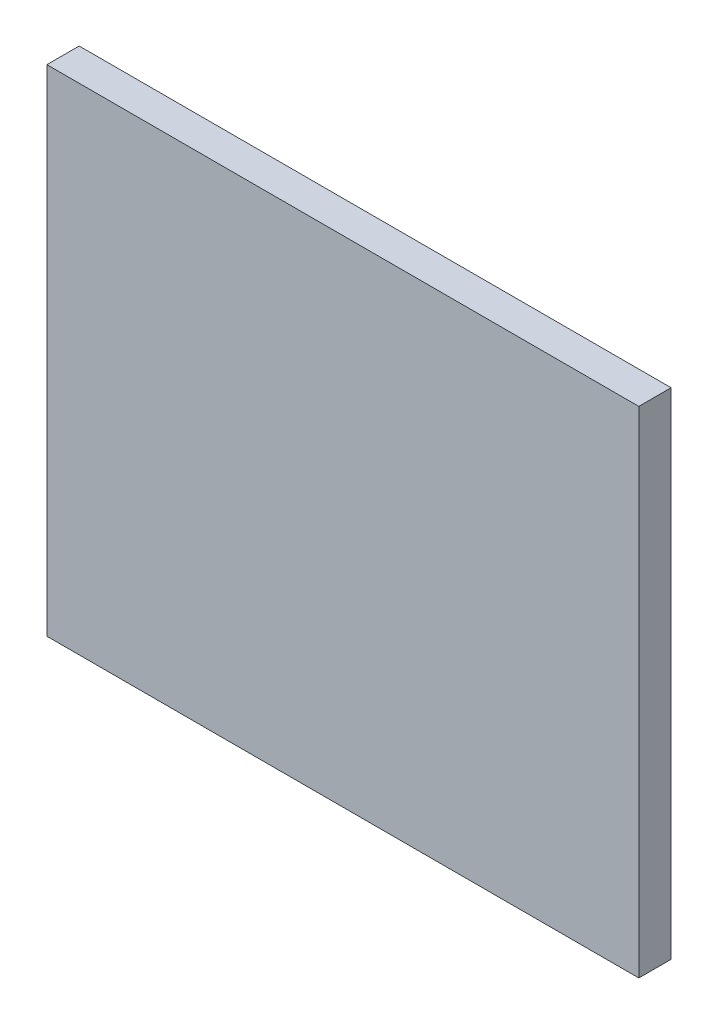
ISO-10303-21;
HEADER;
FILE_DESCRIPTION(('STEP AP214'),'2;1');
FILE_NAME('part.step','',(''),(''),'','','');
FILE_SCHEMA(('AUTOMOTIVE_DESIGN { 1 0 10303 214 1 1 1 1 }'));
ENDSEC;
DATA;
#1=APPLICATION_CONTEXT('core data for automotive mechanical design processes');
#2=APPLICATION_PROTOCOL_DEFINITION('international standard','automotive_design',2000,#1);
#3=PRODUCT_CONTEXT('',#1,'mechanical');
#4=PRODUCT('Part','Part','',(#3));
#5=PRODUCT_RELATED_PRODUCT_CATEGORY('part','',(#4));
#6=PRODUCT_DEFINITION_FORMATION('','',#4);
#7=PRODUCT_DEFINITION_CONTEXT('part definition',#1,'design');
#8=PRODUCT_DEFINITION('design','',#6,#7);
#9=PRODUCT_DEFINITION_SHAPE('','',#8);
#10=(LENGTH_UNIT() NAMED_UNIT(*) SI_UNIT(.MILLI.,.METRE.));
#11=(NAMED_UNIT(*) PLANE_ANGLE_UNIT() SI_UNIT($,.RADIAN.));
#12=(NAMED_UNIT(*) SI_UNIT($,.STERADIAN.) SOLID_ANGLE_UNIT());
#13=UNCERTAINTY_MEASURE_WITH_UNIT(LENGTH_MEASURE(1.E-05),#10,'distance_accuracy_value','');
#14=(GEOMETRIC_REPRESENTATION_CONTEXT(3) GLOBAL_UNCERTAINTY_ASSIGNED_CONTEXT((#13)) GLOBAL_UNIT_ASSIGNED_CONTEXT((#10,
#11,#12)) REPRESENTATION_CONTEXT('',''));
#15=CARTESIAN_POINT('',(0.,0.,0.));
#16=DIRECTION('',(0.,0.,1.));
#17=DIRECTION('',(1.,0.,0.));
#18=AXIS2_PLACEMENT_3D('',#15,#16,#17);
#19=CARTESIAN_POINT('',(0.,0.,0.));
#20=DIRECTION('',(0.,0.,-1.));
#21=DIRECTION('',(-1.,0.,0.));
#22=AXIS2_PLACEMENT_3D('',#19,#20,#21);
#23=PLANE('',#22);
#24=DIRECTION('',(0.,1.,0.));
#25=VECTOR('',#24,1.);
#26=CARTESIAN_POINT('',(27.5,43.,0.));
#27=LINE('',#26,#25);
#28=CARTESIAN_POINT('',(27.5,-3.,0.));
#29=VERTEX_POINT('',#28);
#30=CARTESIAN_POINT('',(27.5,43.,0.));
#31=VERTEX_POINT('',#30);
#32=EDGE_CURVE('E164',#29,#31,#27,.T.);
#33=ORIENTED_EDGE('',*,*,#32,.F.);
#34=DIRECTION('',(1.,0.,0.));
#35=VECTOR('',#34,1.);
#36=CARTESIAN_POINT('',(27.5,-3.,0.));
#37=LINE('',#36,#35);
#38=CARTESIAN_POINT('',(-27.5,-3.,0.));
#39=VERTEX_POINT('',#38);
#40=EDGE_CURVE('E170',#39,#29,#37,.T.);
#41=ORIENTED_EDGE('',*,*,#40,.F.);
#42=DIRECTION('',(0.,-1.,0.));
#43=VECTOR('',#42,1.);
#44=CARTESIAN_POINT('',(-27.5,43.,0.));
#45=LINE('',#44,#43);
#46=CARTESIAN_POINT('',(-27.5,43.,0.));
#47=VERTEX_POINT('',#46);
#48=EDGE_CURVE('E181',#47,#39,#45,.T.);
#49=ORIENTED_EDGE('',*,*,#48,.F.);
#50=DIRECTION('',(-1.,0.,0.));
#51=VECTOR('',#50,1.);
#52=CARTESIAN_POINT('',(27.5,43.,0.));
#53=LINE('',#52,#51);
#54=EDGE_CURVE('E179',#31,#47,#53,.T.);
#55=ORIENTED_EDGE('',*,*,#54,.F.);
#56=EDGE_LOOP('',(#33,#41,#49,#55));
#57=FACE_BOUND('',#56,.T.);
#58=DIRECTION('',(0.,-1.,0.));
#59=VECTOR('',#58,1.);
#60=CARTESIAN_POINT('',(24.1,17.5,0.));
#61=LINE('',#60,#59);
#62=CARTESIAN_POINT('',(24.1,24.5,0.));
#63=VERTEX_POINT('',#62);
#64=CARTESIAN_POINT('',(24.1,15.5,0.));
#65=VERTEX_POINT('',#64);
#66=EDGE_CURVE('E152',#63,#65,#61,.T.);
#67=ORIENTED_EDGE('',*,*,#66,.F.);
#68=DIRECTION('',(-1.,0.,0.));
#69=VECTOR('',#68,1.);
#70=CARTESIAN_POINT('',(0.,24.5,0.));
#71=LINE('',#70,#69);
#72=CARTESIAN_POINT('',(19.1,24.5,0.));
#73=VERTEX_POINT('',#72);
#74=EDGE_CURVE('E200',#63,#73,#71,.T.);
#75=ORIENTED_EDGE('',*,*,#74,.T.);
#76=DIRECTION('',(0.,-1.,0.));
#77=VECTOR('',#76,1.);
#78=CARTESIAN_POINT('',(19.1,0.,0.));
#79=LINE('',#78,#77);
#80=CARTESIAN_POINT('',(19.1,15.5,0.));
#81=VERTEX_POINT('',#80);
#82=EDGE_CURVE('E198',#73,#81,#79,.T.);
#83=ORIENTED_EDGE('',*,*,#82,.T.);
#84=DIRECTION('',(1.,0.,0.));
#85=VECTOR('',#84,1.);
#86=CARTESIAN_POINT('',(0.,15.5,0.));
#87=LINE('',#86,#85);
#88=EDGE_CURVE('E195',#81,#65,#87,.T.);
#89=ORIENTED_EDGE('',*,*,#88,.T.);
#90=EDGE_LOOP('',(#67,#75,#83,#89));
#91=FACE_BOUND('',#90,.T.);
#92=DIRECTION('',(0.,1.,0.));
#93=VECTOR('',#92,1.);
#94=CARTESIAN_POINT('',(-24.1,17.5,0.));
#95=LINE('',#94,#93);
#96=CARTESIAN_POINT('',(-24.1,15.5,0.));
#97=VERTEX_POINT('',#96);
#98=CARTESIAN_POINT('',(-24.1,24.5,0.));
#99=VERTEX_POINT('',#98);
#100=EDGE_CURVE('E53',#97,#99,#95,.T.);
#101=ORIENTED_EDGE('',*,*,#100,.F.);
#102=DIRECTION('',(1.,0.,0.));
#103=VECTOR('',#102,1.);
#104=CARTESIAN_POINT('',(0.,15.5,0.));
#105=LINE('',#104,#103);
#106=CARTESIAN_POINT('',(-19.1,15.5,0.));
#107=VERTEX_POINT('',#106);
#108=EDGE_CURVE('E58',#97,#107,#105,.T.);
#109=ORIENTED_EDGE('',*,*,#108,.T.);
#110=DIRECTION('',(0.,1.,0.));
#111=VECTOR('',#110,1.);
#112=CARTESIAN_POINT('',(-19.0999999999999,0.,0.));
#113=LINE('',#112,#111);
#114=CARTESIAN_POINT('',(-19.1,24.5,0.));
#115=VERTEX_POINT('',#114);
#116=EDGE_CURVE('E141',#107,#115,#113,.T.);
#117=ORIENTED_EDGE('',*,*,#116,.T.);
#118=DIRECTION('',(-1.,0.,0.));
#119=VECTOR('',#118,1.);
#120=CARTESIAN_POINT('',(0.,24.5,0.));
#121=LINE('',#120,#119);
#122=EDGE_CURVE('E202',#115,#99,#121,.T.);
#123=ORIENTED_EDGE('',*,*,#122,.T.);
#124=EDGE_LOOP('',(#101,#109,#117,#123));
#125=FACE_BOUND('',#124,.T.);
#126=ADVANCED_FACE('F35',(#57,#91,#125),#23,.T.);
#127=CARTESIAN_POINT('',(27.5,43.,3.));
#128=DIRECTION('',(-1.,0.,0.));
#129=DIRECTION('',(0.,0.,1.));
#130=AXIS2_PLACEMENT_3D('',#127,#128,#129);
#131=PLANE('',#130);
#132=ORIENTED_EDGE('',*,*,#32,.T.);
#133=DIRECTION('',(0.,0.,-1.));
#134=VECTOR('',#133,1.);
#135=CARTESIAN_POINT('',(27.5,43.,3.));
#136=LINE('',#135,#134);
#137=CARTESIAN_POINT('',(27.5,43.,3.));
#138=VERTEX_POINT('',#137);
#139=EDGE_CURVE('E192',#138,#31,#136,.T.);
#140=ORIENTED_EDGE('',*,*,#139,.F.);
#141=DIRECTION('',(0.,1.,0.));
#142=VECTOR('',#141,1.);
#143=CARTESIAN_POINT('',(27.5,43.,3.));
#144=LINE('',#143,#142);
#145=CARTESIAN_POINT('',(27.5,-3.,3.));
#146=VERTEX_POINT('',#145);
#147=EDGE_CURVE('E166',#146,#138,#144,.T.);
#148=ORIENTED_EDGE('',*,*,#147,.F.);
#149=DIRECTION('',(0.,0.,-1.));
#150=VECTOR('',#149,1.);
#151=CARTESIAN_POINT('',(27.5,-3.,3.));
#152=LINE('',#151,#150);
#153=EDGE_CURVE('E176',#146,#29,#152,.T.);
#154=ORIENTED_EDGE('',*,*,#153,.T.);
#155=EDGE_LOOP('',(#132,#140,#148,#154));
#156=FACE_BOUND('',#155,.T.);
#157=ADVANCED_FACE('F247',(#156),#131,.F.);
#158=CARTESIAN_POINT('',(27.5,43.,3.));
#159=DIRECTION('',(0.,-1.,0.));
#160=DIRECTION('',(0.,0.,-1.));
#161=AXIS2_PLACEMENT_3D('',#158,#159,#160);
#162=PLANE('',#161);
#163=ORIENTED_EDGE('',*,*,#54,.T.);
#164=DIRECTION('',(0.,0.,-1.));
#165=VECTOR('',#164,1.);
#166=CARTESIAN_POINT('',(-27.5,43.,3.));
#167=LINE('',#166,#165);
#168=CARTESIAN_POINT('',(-27.5,43.,3.));
#169=VERTEX_POINT('',#168);
#170=EDGE_CURVE('E189',#169,#47,#167,.T.);
#171=ORIENTED_EDGE('',*,*,#170,.F.);
#172=DIRECTION('',(-1.,0.,0.));
#173=VECTOR('',#172,1.);
#174=CARTESIAN_POINT('',(27.5,43.,3.));
#175=LINE('',#174,#173);
#176=EDGE_CURVE('E169',#138,#169,#175,.T.);
#177=ORIENTED_EDGE('',*,*,#176,.F.);
#178=ORIENTED_EDGE('',*,*,#139,.T.);
#179=EDGE_LOOP('',(#163,#171,#177,#178));
#180=FACE_BOUND('',#179,.T.);
#181=ADVANCED_FACE('F253',(#180),#162,.F.);
#182=CARTESIAN_POINT('',(-27.5,43.,3.));
#183=DIRECTION('',(1.,0.,0.));
#184=DIRECTION('',(0.,0.,-1.));
#185=AXIS2_PLACEMENT_3D('',#182,#183,#184);
#186=PLANE('',#185);
#187=ORIENTED_EDGE('',*,*,#48,.T.);
#188=DIRECTION('',(0.,0.,-1.));
#189=VECTOR('',#188,1.);
#190=CARTESIAN_POINT('',(-27.5,-3.,3.));
#191=LINE('',#190,#189);
#192=CARTESIAN_POINT('',(-27.5,-3.,3.));
#193=VERTEX_POINT('',#192);
#194=EDGE_CURVE('E186',#193,#39,#191,.T.);
#195=ORIENTED_EDGE('',*,*,#194,.F.);
#196=DIRECTION('',(0.,-1.,0.));
#197=VECTOR('',#196,1.);
#198=CARTESIAN_POINT('',(-27.5,43.,3.));
#199=LINE('',#198,#197);
#200=EDGE_CURVE('E172',#169,#193,#199,.T.);
#201=ORIENTED_EDGE('',*,*,#200,.F.);
#202=ORIENTED_EDGE('',*,*,#170,.T.);
#203=EDGE_LOOP('',(#187,#195,#201,#202));
#204=FACE_BOUND('',#203,.T.);
#205=ADVANCED_FACE('F260',(#204),#186,.F.);
#206=CARTESIAN_POINT('',(27.5,-3.,3.));
#207=DIRECTION('',(0.,1.,0.));
#208=DIRECTION('',(0.,0.,1.));
#209=AXIS2_PLACEMENT_3D('',#206,#207,#208);
#210=PLANE('',#209);
#211=ORIENTED_EDGE('',*,*,#40,.T.);
#212=ORIENTED_EDGE('',*,*,#153,.F.);
#213=DIRECTION('',(1.,0.,0.));
#214=VECTOR('',#213,1.);
#215=CARTESIAN_POINT('',(27.5,-3.,3.));
#216=LINE('',#215,#214);
#217=EDGE_CURVE('E174',#193,#146,#216,.T.);
#218=ORIENTED_EDGE('',*,*,#217,.F.);
#219=ORIENTED_EDGE('',*,*,#194,.T.);
#220=EDGE_LOOP('',(#211,#212,#218,#219));
#221=FACE_BOUND('',#220,.T.);
#222=ADVANCED_FACE('F243',(#221),#210,.F.);
#223=CARTESIAN_POINT('',(0.,0.,3.));
#224=DIRECTION('',(0.,0.,-1.));
#225=DIRECTION('',(-1.,0.,0.));
#226=AXIS2_PLACEMENT_3D('',#223,#224,#225);
#227=PLANE('',#226);
#228=ORIENTED_EDGE('',*,*,#147,.T.);
#229=ORIENTED_EDGE('',*,*,#176,.T.);
#230=ORIENTED_EDGE('',*,*,#200,.T.);
#231=ORIENTED_EDGE('',*,*,#217,.T.);
#232=EDGE_LOOP('',(#228,#229,#230,#231));
#233=FACE_BOUND('',#232,.T.);
#234=ADVANCED_FACE('F235',(#233),#227,.F.);
#235=CARTESIAN_POINT('',(24.1,17.5,-2.));
#236=DIRECTION('',(-1.,0.,0.));
#237=DIRECTION('',(0.,0.,1.));
#238=AXIS2_PLACEMENT_3D('',#235,#236,#237);
#239=PLANE('',#238);
#240=ORIENTED_EDGE('',*,*,#66,.T.);
#241=DIRECTION('',(0.,0.707106781186548,-0.707106781186547));
#242=VECTOR('',#241,1.);
#243=CARTESIAN_POINT('',(24.1,17.5,-2.));
#244=LINE('',#243,#242);
#245=CARTESIAN_POINT('',(24.1,17.5,-2.));
#246=VERTEX_POINT('',#245);
#247=EDGE_CURVE('E11',#65,#246,#244,.T.);
#248=ORIENTED_EDGE('',*,*,#247,.T.);
#249=DIRECTION('',(0.,-1.,0.));
#250=VECTOR('',#249,1.);
#251=CARTESIAN_POINT('',(24.1,17.5,-2.));
#252=LINE('',#251,#250);
#253=CARTESIAN_POINT('',(24.1,22.5,-2.));
#254=VERTEX_POINT('',#253);
#255=EDGE_CURVE('E154',#254,#246,#252,.T.);
#256=ORIENTED_EDGE('',*,*,#255,.F.);
#257=DIRECTION('',(0.,0.707106781186548,0.707106781186547));
#258=VECTOR('',#257,1.);
#259=CARTESIAN_POINT('',(24.1,20.,-4.5));
#260=LINE('',#259,#258);
#261=EDGE_CURVE('E45',#254,#63,#260,.T.);
#262=ORIENTED_EDGE('',*,*,#261,.T.);
#263=EDGE_LOOP('',(#240,#248,#256,#262));
#264=FACE_BOUND('',#263,.T.);
#265=ADVANCED_FACE('F233',(#264),#239,.F.);
#266=CARTESIAN_POINT('',(0.,0.,-2.));
#267=DIRECTION('',(0.,0.,-1.));
#268=DIRECTION('',(-1.,0.,0.));
#269=AXIS2_PLACEMENT_3D('',#266,#267,#268);
#270=PLANE('',#269);
#271=ORIENTED_EDGE('',*,*,#255,.T.);
#272=DIRECTION('',(-1.,0.,0.));
#273=VECTOR('',#272,1.);
#274=CARTESIAN_POINT('',(21.1,17.5,-2.));
#275=LINE('',#274,#273);
#276=CARTESIAN_POINT('',(21.1,17.5,-2.));
#277=VERTEX_POINT('',#276);
#278=EDGE_CURVE('E157',#246,#277,#275,.T.);
#279=ORIENTED_EDGE('',*,*,#278,.T.);
#280=DIRECTION('',(0.,1.,0.));
#281=VECTOR('',#280,1.);
#282=CARTESIAN_POINT('',(21.1,17.5,-2.));
#283=LINE('',#282,#281);
#284=CARTESIAN_POINT('',(21.1,22.5,-2.));
#285=VERTEX_POINT('',#284);
#286=EDGE_CURVE('E159',#277,#285,#283,.T.);
#287=ORIENTED_EDGE('',*,*,#286,.T.);
#288=DIRECTION('',(1.,0.,0.));
#289=VECTOR('',#288,1.);
#290=CARTESIAN_POINT('',(21.1,22.5,-2.));
#291=LINE('',#290,#289);
#292=EDGE_CURVE('E161',#285,#254,#291,.T.);
#293=ORIENTED_EDGE('',*,*,#292,.T.);
#294=EDGE_LOOP('',(#271,#279,#287,#293));
#295=FACE_BOUND('',#294,.T.);
#296=ADVANCED_FACE('F232',(#295),#270,.T.);
#297=CARTESIAN_POINT('',(-24.1,17.5,-2.));
#298=DIRECTION('',(1.,0.,0.));
#299=DIRECTION('',(0.,1.,0.));
#300=AXIS2_PLACEMENT_3D('',#297,#298,#299);
#301=PLANE('',#300);
#302=ORIENTED_EDGE('',*,*,#100,.T.);
#303=DIRECTION('',(0.,-0.707106781186549,-0.707106781186546));
#304=VECTOR('',#303,1.);
#305=CARTESIAN_POINT('',(-24.1,19.9999999999999,-4.5));
#306=LINE('',#305,#304);
#307=CARTESIAN_POINT('',(-24.1,22.5,-2.));
#308=VERTEX_POINT('',#307);
#309=EDGE_CURVE('E207',#99,#308,#306,.T.);
#310=ORIENTED_EDGE('',*,*,#309,.T.);
#311=DIRECTION('',(0.,1.,0.));
#312=VECTOR('',#311,1.);
#313=CARTESIAN_POINT('',(-24.1,17.5,-2.));
#314=LINE('',#313,#312);
#315=CARTESIAN_POINT('',(-24.1,17.5,-2.));
#316=VERTEX_POINT('',#315);
#317=EDGE_CURVE('E147',#316,#308,#314,.T.);
#318=ORIENTED_EDGE('',*,*,#317,.F.);
#319=DIRECTION('',(0.,-0.707106781186549,0.707106781186546));
#320=VECTOR('',#319,1.);
#321=CARTESIAN_POINT('',(-24.1,17.5,-2.));
#322=LINE('',#321,#320);
#323=EDGE_CURVE('E146',#316,#97,#322,.T.);
#324=ORIENTED_EDGE('',*,*,#323,.T.);
#325=EDGE_LOOP('',(#302,#310,#318,#324));
#326=FACE_BOUND('',#325,.T.);
#327=ADVANCED_FACE('F241',(#326),#301,.F.);
#328=CARTESIAN_POINT('',(0.,0.,-2.));
#329=DIRECTION('',(0.,0.,1.));
#330=DIRECTION('',(1.,0.,0.));
#331=AXIS2_PLACEMENT_3D('',#328,#329,#330);
#332=PLANE('',#331);
#333=DIRECTION('',(0.,-1.,0.));
#334=VECTOR('',#333,1.);
#335=CARTESIAN_POINT('',(-21.1,17.5,-2.));
#336=LINE('',#335,#334);
#337=CARTESIAN_POINT('',(-21.1,22.5,-2.));
#338=VERTEX_POINT('',#337);
#339=CARTESIAN_POINT('',(-21.1,17.5,-2.));
#340=VERTEX_POINT('',#339);
#341=EDGE_CURVE('E125',#338,#340,#336,.T.);
#342=ORIENTED_EDGE('',*,*,#341,.T.);
#343=DIRECTION('',(-1.,0.,0.));
#344=VECTOR('',#343,1.);
#345=CARTESIAN_POINT('',(-21.1,17.5,-2.));
#346=LINE('',#345,#344);
#347=EDGE_CURVE('E130',#340,#316,#346,.T.);
#348=ORIENTED_EDGE('',*,*,#347,.T.);
#349=ORIENTED_EDGE('',*,*,#317,.T.);
#350=DIRECTION('',(1.,0.,0.));
#351=VECTOR('',#350,1.);
#352=CARTESIAN_POINT('',(-21.1,22.5,-2.));
#353=LINE('',#352,#351);
#354=EDGE_CURVE('E133',#308,#338,#353,.T.);
#355=ORIENTED_EDGE('',*,*,#354,.T.);
#356=EDGE_LOOP('',(#342,#348,#349,#355));
#357=FACE_BOUND('',#356,.T.);
#358=ADVANCED_FACE('F127',(#357),#332,.F.);
#359=CARTESIAN_POINT('',(-21.1,22.5,-2.));
#360=DIRECTION('',(0.,-0.707106781186546,0.707106781186549));
#361=DIRECTION('',(1.,0.,0.));
#362=AXIS2_PLACEMENT_3D('',#359,#360,#361);
#363=PLANE('',#362);
#364=ORIENTED_EDGE('',*,*,#309,.F.);
#365=ORIENTED_EDGE('',*,*,#122,.F.);
#366=DIRECTION('',(-0.577350269189625,-0.577350269189628,-0.577350269189624));
#367=VECTOR('',#366,1.);
#368=CARTESIAN_POINT('',(-21.1,22.5,-2.));
#369=LINE('',#368,#367);
#370=EDGE_CURVE('E143',#338,#115,#369,.F.);
#371=ORIENTED_EDGE('',*,*,#370,.F.);
#372=ORIENTED_EDGE('',*,*,#354,.F.);
#373=EDGE_LOOP('',(#364,#365,#371,#372));
#374=FACE_BOUND('',#373,.T.);
#375=ADVANCED_FACE('F279',(#374),#363,.F.);
#376=CARTESIAN_POINT('',(-21.1,17.5,-2.));
#377=DIRECTION('',(-0.707106781186546,0.,0.707106781186549));
#378=DIRECTION('',(0.,-1.,0.));
#379=AXIS2_PLACEMENT_3D('',#376,#377,#378);
#380=PLANE('',#379);
#381=ORIENTED_EDGE('',*,*,#370,.T.);
#382=ORIENTED_EDGE('',*,*,#116,.F.);
#383=DIRECTION('',(-0.577350269189628,0.577350269189626,-0.577350269189624));
#384=VECTOR('',#383,1.);
#385=CARTESIAN_POINT('',(-21.1,17.5,-2.));
#386=LINE('',#385,#384);
#387=EDGE_CURVE('E139',#340,#107,#386,.F.);
#388=ORIENTED_EDGE('',*,*,#387,.F.);
#389=ORIENTED_EDGE('',*,*,#341,.F.);
#390=EDGE_LOOP('',(#381,#382,#388,#389));
#391=FACE_BOUND('',#390,.T.);
#392=ADVANCED_FACE('F140',(#391),#380,.F.);
#393=CARTESIAN_POINT('',(-21.1,17.5,-2.));
#394=DIRECTION('',(0.,0.707106781186546,0.707106781186549));
#395=DIRECTION('',(-1.,0.,0.));
#396=AXIS2_PLACEMENT_3D('',#393,#394,#395);
#397=PLANE('',#396);
#398=ORIENTED_EDGE('',*,*,#387,.T.);
#399=ORIENTED_EDGE('',*,*,#108,.F.);
#400=ORIENTED_EDGE('',*,*,#323,.F.);
#401=ORIENTED_EDGE('',*,*,#347,.F.);
#402=EDGE_LOOP('',(#398,#399,#400,#401));
#403=FACE_BOUND('',#402,.T.);
#404=ADVANCED_FACE('F145',(#403),#397,.F.);
#405=CARTESIAN_POINT('',(21.1,17.5,-2.));
#406=DIRECTION('',(0.,0.707106781186547,0.707106781186548));
#407=DIRECTION('',(-1.,0.,0.));
#408=AXIS2_PLACEMENT_3D('',#405,#406,#407);
#409=PLANE('',#408);
#410=ORIENTED_EDGE('',*,*,#247,.F.);
#411=ORIENTED_EDGE('',*,*,#88,.F.);
#412=DIRECTION('',(0.577350269189626,0.577350269189626,-0.577350269189626));
#413=VECTOR('',#412,1.);
#414=CARTESIAN_POINT('',(21.1,17.5,-2.));
#415=LINE('',#414,#413);
#416=EDGE_CURVE('E40',#277,#81,#415,.F.);
#417=ORIENTED_EDGE('',*,*,#416,.F.);
#418=ORIENTED_EDGE('',*,*,#278,.F.);
#419=EDGE_LOOP('',(#410,#411,#417,#418));
#420=FACE_BOUND('',#419,.T.);
#421=ADVANCED_FACE('F38',(#420),#409,.F.);
#422=CARTESIAN_POINT('',(21.1,17.5,-2.));
#423=DIRECTION('',(0.707106781186547,0.,0.707106781186548));
#424=DIRECTION('',(0.,1.,0.));
#425=AXIS2_PLACEMENT_3D('',#422,#423,#424);
#426=PLANE('',#425);
#427=ORIENTED_EDGE('',*,*,#416,.T.);
#428=ORIENTED_EDGE('',*,*,#82,.F.);
#429=DIRECTION('',(0.577350269189626,-0.577350269189626,-0.577350269189626));
#430=VECTOR('',#429,1.);
#431=CARTESIAN_POINT('',(22.7666666666667,20.8333333333333,-3.66666666666667));
#432=LINE('',#431,#430);
#433=EDGE_CURVE('E211',#285,#73,#432,.F.);
#434=ORIENTED_EDGE('',*,*,#433,.F.);
#435=ORIENTED_EDGE('',*,*,#286,.F.);
#436=EDGE_LOOP('',(#427,#428,#434,#435));
#437=FACE_BOUND('',#436,.T.);
#438=ADVANCED_FACE('F222',(#437),#426,.F.);
#439=CARTESIAN_POINT('',(21.1,22.5,-2.));
#440=DIRECTION('',(0.,-0.707106781186547,0.707106781186548));
#441=DIRECTION('',(1.,0.,0.));
#442=AXIS2_PLACEMENT_3D('',#439,#440,#441);
#443=PLANE('',#442);
#444=ORIENTED_EDGE('',*,*,#433,.T.);
#445=ORIENTED_EDGE('',*,*,#74,.F.);
#446=ORIENTED_EDGE('',*,*,#261,.F.);
#447=ORIENTED_EDGE('',*,*,#292,.F.);
#448=EDGE_LOOP('',(#444,#445,#446,#447));
#449=FACE_BOUND('',#448,.T.);
#450=ADVANCED_FACE('F228',(#449),#443,.F.);
#451=CLOSED_SHELL('',(#126,#157,#181,#205,#222,#234,#265,#296,#327,#358,#375,#392,#404,#421,
#438,#450));
#452=MANIFOLD_SOLID_BREP('B2',#451);
#453=ADVANCED_BREP_SHAPE_REPRESENTATION('',(#18,#452),#14);
#454=SHAPE_DEFINITION_REPRESENTATION(#9,#453);
ENDSEC;
END-ISO-10303-21;
